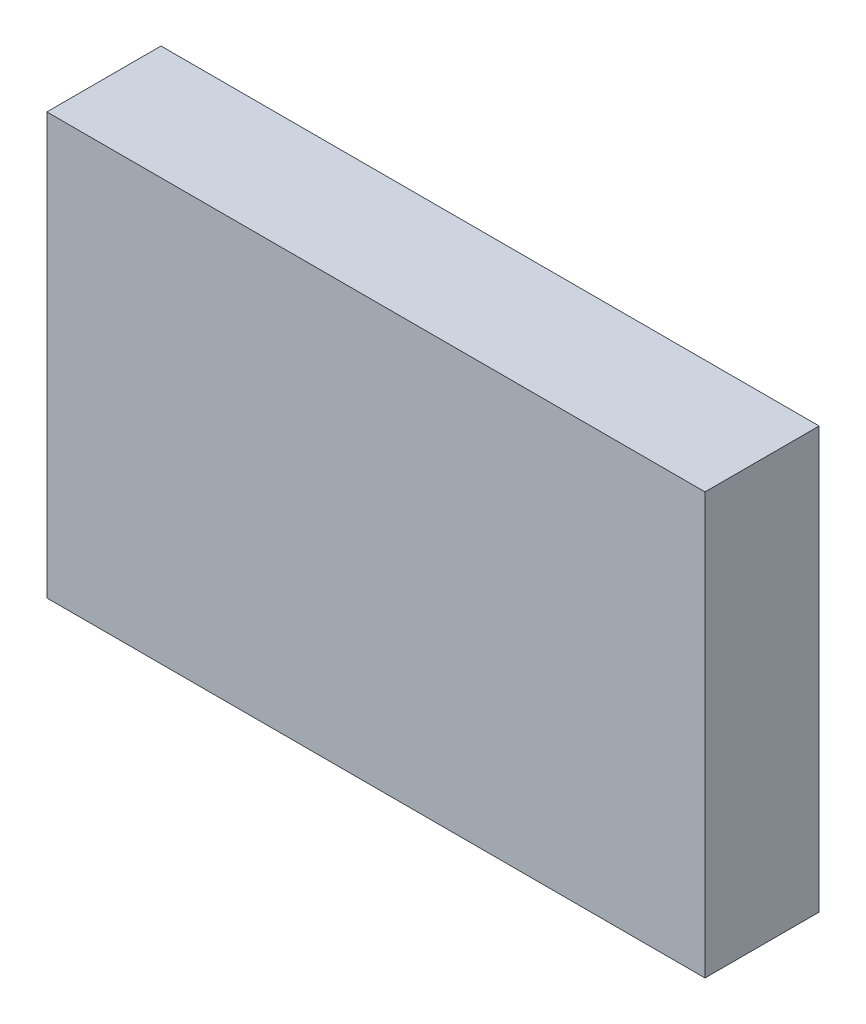
ISO-10303-21;
HEADER;
FILE_DESCRIPTION(('STEP AP214'),'2;1');
FILE_NAME('part.step','',(''),(''),'','','');
FILE_SCHEMA(('AUTOMOTIVE_DESIGN { 1 0 10303 214 1 1 1 1 }'));
ENDSEC;
DATA;
#1=APPLICATION_CONTEXT('core data for automotive mechanical design processes');
#2=APPLICATION_PROTOCOL_DEFINITION('international standard','automotive_design',2000,#1);
#3=PRODUCT_CONTEXT('',#1,'mechanical');
#4=PRODUCT('Part','Part','',(#3));
#5=PRODUCT_RELATED_PRODUCT_CATEGORY('part','',(#4));
#6=PRODUCT_DEFINITION_FORMATION('','',#4);
#7=PRODUCT_DEFINITION_CONTEXT('part definition',#1,'design');
#8=PRODUCT_DEFINITION('design','',#6,#7);
#9=PRODUCT_DEFINITION_SHAPE('','',#8);
#10=(LENGTH_UNIT() NAMED_UNIT(*) SI_UNIT(.MILLI.,.METRE.));
#11=(NAMED_UNIT(*) PLANE_ANGLE_UNIT() SI_UNIT($,.RADIAN.));
#12=(NAMED_UNIT(*) SI_UNIT($,.STERADIAN.) SOLID_ANGLE_UNIT());
#13=UNCERTAINTY_MEASURE_WITH_UNIT(LENGTH_MEASURE(1.E-05),#10,'distance_accuracy_value','');
#14=(GEOMETRIC_REPRESENTATION_CONTEXT(3) GLOBAL_UNCERTAINTY_ASSIGNED_CONTEXT((#13)) GLOBAL_UNIT_ASSIGNED_CONTEXT((#10,
#11,#12)) REPRESENTATION_CONTEXT('',''));
#15=CARTESIAN_POINT('',(0.,0.,0.));
#16=DIRECTION('',(0.,0.,1.));
#17=DIRECTION('',(1.,0.,0.));
#18=AXIS2_PLACEMENT_3D('',#15,#16,#17);
#19=CARTESIAN_POINT('',(0.,0.,10.));
#20=DIRECTION('',(1.,0.,0.));
#21=DIRECTION('',(0.,0.,-1.));
#22=AXIS2_PLACEMENT_3D('',#19,#20,#21);
#23=PLANE('',#22);
#24=DIRECTION('',(0.,-1.,0.));
#25=VECTOR('',#24,1.);
#26=CARTESIAN_POINT('',(0.,0.,0.));
#27=LINE('',#26,#25);
#28=CARTESIAN_POINT('',(0.,36.8845259391771,0.));
#29=VERTEX_POINT('',#28);
#30=CARTESIAN_POINT('',(0.,0.,0.));
#31=VERTEX_POINT('',#30);
#32=EDGE_CURVE('E96',#29,#31,#27,.T.);
#33=ORIENTED_EDGE('',*,*,#32,.T.);
#34=DIRECTION('',(0.,0.,-1.));
#35=VECTOR('',#34,1.);
#36=CARTESIAN_POINT('',(0.,0.,10.));
#37=LINE('',#36,#35);
#38=CARTESIAN_POINT('',(0.,0.,10.));
#39=VERTEX_POINT('',#38);
#40=EDGE_CURVE('E11',#39,#31,#37,.T.);
#41=ORIENTED_EDGE('',*,*,#40,.F.);
#42=DIRECTION('',(0.,-1.,0.));
#43=VECTOR('',#42,1.);
#44=CARTESIAN_POINT('',(0.,0.,10.));
#45=LINE('',#44,#43);
#46=CARTESIAN_POINT('',(0.,36.8845259391771,10.));
#47=VERTEX_POINT('',#46);
#48=EDGE_CURVE('E84',#47,#39,#45,.T.);
#49=ORIENTED_EDGE('',*,*,#48,.F.);
#50=DIRECTION('',(0.,0.,-1.));
#51=VECTOR('',#50,1.);
#52=CARTESIAN_POINT('',(0.,36.8845259391771,10.));
#53=LINE('',#52,#51);
#54=EDGE_CURVE('E92',#47,#29,#53,.T.);
#55=ORIENTED_EDGE('',*,*,#54,.T.);
#56=EDGE_LOOP('',(#33,#41,#49,#55));
#57=FACE_BOUND('',#56,.T.);
#58=ADVANCED_FACE('F33',(#57),#23,.F.);
#59=CARTESIAN_POINT('',(0.,0.,10.));
#60=DIRECTION('',(0.,1.,0.));
#61=DIRECTION('',(0.,0.,1.));
#62=AXIS2_PLACEMENT_3D('',#59,#60,#61);
#63=PLANE('',#62);
#64=DIRECTION('',(1.,0.,0.));
#65=VECTOR('',#64,1.);
#66=CARTESIAN_POINT('',(0.,0.,0.));
#67=LINE('',#66,#65);
#68=CARTESIAN_POINT('',(57.6639691817888,0.,0.));
#69=VERTEX_POINT('',#68);
#70=EDGE_CURVE('E88',#31,#69,#67,.T.);
#71=ORIENTED_EDGE('',*,*,#70,.T.);
#72=DIRECTION('',(0.,0.,-1.));
#73=VECTOR('',#72,1.);
#74=CARTESIAN_POINT('',(57.6639691817888,0.,10.));
#75=LINE('',#74,#73);
#76=CARTESIAN_POINT('',(57.6639691817888,0.,10.));
#77=VERTEX_POINT('',#76);
#78=EDGE_CURVE('E41',#77,#69,#75,.T.);
#79=ORIENTED_EDGE('',*,*,#78,.F.);
#80=DIRECTION('',(1.,0.,0.));
#81=VECTOR('',#80,1.);
#82=CARTESIAN_POINT('',(0.,0.,10.));
#83=LINE('',#82,#81);
#84=EDGE_CURVE('E79',#39,#77,#83,.T.);
#85=ORIENTED_EDGE('',*,*,#84,.F.);
#86=ORIENTED_EDGE('',*,*,#40,.T.);
#87=EDGE_LOOP('',(#71,#79,#85,#86));
#88=FACE_BOUND('',#87,.T.);
#89=ADVANCED_FACE('F87',(#88),#63,.F.);
#90=CARTESIAN_POINT('',(57.6639691817888,0.,10.));
#91=DIRECTION('',(-1.,0.,0.));
#92=DIRECTION('',(0.,0.,1.));
#93=AXIS2_PLACEMENT_3D('',#90,#91,#92);
#94=PLANE('',#93);
#95=DIRECTION('',(0.,1.,0.));
#96=VECTOR('',#95,1.);
#97=CARTESIAN_POINT('',(57.6639691817888,0.,0.));
#98=LINE('',#97,#96);
#99=CARTESIAN_POINT('',(57.6639691817888,36.8845259391771,0.));
#100=VERTEX_POINT('',#99);
#101=EDGE_CURVE('E66',#69,#100,#98,.T.);
#102=ORIENTED_EDGE('',*,*,#101,.T.);
#103=DIRECTION('',(0.,0.,-1.));
#104=VECTOR('',#103,1.);
#105=CARTESIAN_POINT('',(57.6639691817888,36.8845259391771,10.));
#106=LINE('',#105,#104);
#107=CARTESIAN_POINT('',(57.6639691817888,36.8845259391771,10.));
#108=VERTEX_POINT('',#107);
#109=EDGE_CURVE('E89',#108,#100,#106,.T.);
#110=ORIENTED_EDGE('',*,*,#109,.F.);
#111=DIRECTION('',(0.,1.,0.));
#112=VECTOR('',#111,1.);
#113=CARTESIAN_POINT('',(57.6639691817888,0.,10.));
#114=LINE('',#113,#112);
#115=EDGE_CURVE('E82',#77,#108,#114,.T.);
#116=ORIENTED_EDGE('',*,*,#115,.F.);
#117=ORIENTED_EDGE('',*,*,#78,.T.);
#118=EDGE_LOOP('',(#102,#110,#116,#117));
#119=FACE_BOUND('',#118,.T.);
#120=ADVANCED_FACE('F90',(#119),#94,.F.);
#121=CARTESIAN_POINT('',(0.,36.8845259391771,10.));
#122=DIRECTION('',(0.,-1.,0.));
#123=DIRECTION('',(0.,0.,-1.));
#124=AXIS2_PLACEMENT_3D('',#121,#122,#123);
#125=PLANE('',#124);
#126=DIRECTION('',(-1.,0.,0.));
#127=VECTOR('',#126,1.);
#128=CARTESIAN_POINT('',(0.,36.8845259391771,0.));
#129=LINE('',#128,#127);
#130=EDGE_CURVE('E72',#100,#29,#129,.T.);
#131=ORIENTED_EDGE('',*,*,#130,.T.);
#132=ORIENTED_EDGE('',*,*,#54,.F.);
#133=DIRECTION('',(-1.,0.,0.));
#134=VECTOR('',#133,1.);
#135=CARTESIAN_POINT('',(0.,36.8845259391771,10.));
#136=LINE('',#135,#134);
#137=EDGE_CURVE('E49',#108,#47,#136,.T.);
#138=ORIENTED_EDGE('',*,*,#137,.F.);
#139=ORIENTED_EDGE('',*,*,#109,.T.);
#140=EDGE_LOOP('',(#131,#132,#138,#139));
#141=FACE_BOUND('',#140,.T.);
#142=ADVANCED_FACE('F103',(#141),#125,.F.);
#143=CARTESIAN_POINT('',(0.,0.,10.));
#144=DIRECTION('',(0.,0.,-1.));
#145=DIRECTION('',(-1.,0.,0.));
#146=AXIS2_PLACEMENT_3D('',#143,#144,#145);
#147=PLANE('',#146);
#148=ORIENTED_EDGE('',*,*,#48,.T.);
#149=ORIENTED_EDGE('',*,*,#84,.T.);
#150=ORIENTED_EDGE('',*,*,#115,.T.);
#151=ORIENTED_EDGE('',*,*,#137,.T.);
#152=EDGE_LOOP('',(#148,#149,#150,#151));
#153=FACE_BOUND('',#152,.T.);
#154=ADVANCED_FACE('F80',(#153),#147,.F.);
#155=CARTESIAN_POINT('',(0.,0.,0.));
#156=DIRECTION('',(0.,0.,-1.));
#157=DIRECTION('',(-1.,0.,0.));
#158=AXIS2_PLACEMENT_3D('',#155,#156,#157);
#159=PLANE('',#158);
#160=ORIENTED_EDGE('',*,*,#32,.F.);
#161=ORIENTED_EDGE('',*,*,#130,.F.);
#162=ORIENTED_EDGE('',*,*,#101,.F.);
#163=ORIENTED_EDGE('',*,*,#70,.F.);
#164=EDGE_LOOP('',(#160,#161,#162,#163));
#165=FACE_BOUND('',#164,.T.);
#166=ADVANCED_FACE('F106',(#165),#159,.T.);
#167=CLOSED_SHELL('',(#58,#89,#120,#142,#154,#166));
#168=MANIFOLD_SOLID_BREP('B2',#167);
#169=ADVANCED_BREP_SHAPE_REPRESENTATION('',(#18,#168),#14);
#170=SHAPE_DEFINITION_REPRESENTATION(#9,#169);
ENDSEC;
END-ISO-10303-21;
